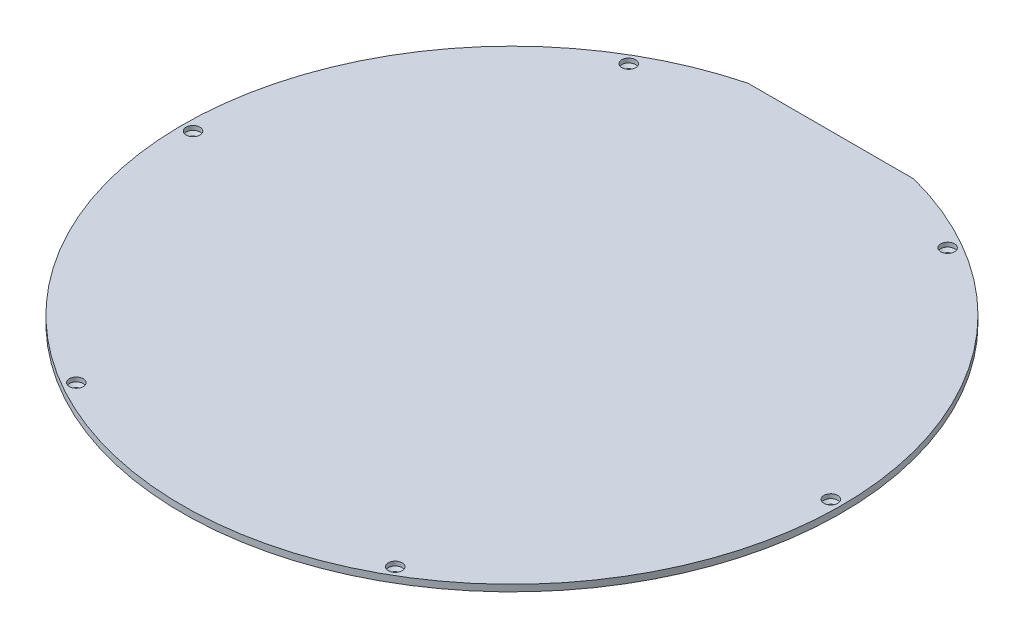
ISO-10303-21;
HEADER;
FILE_DESCRIPTION(('STEP AP214'),'2;1');
FILE_NAME('part.step','',(''),(''),'','','');
FILE_SCHEMA(('AUTOMOTIVE_DESIGN { 1 0 10303 214 1 1 1 1 }'));
ENDSEC;
DATA;
#1=APPLICATION_CONTEXT('core data for automotive mechanical design processes');
#2=APPLICATION_PROTOCOL_DEFINITION('international standard','automotive_design',2000,#1);
#3=PRODUCT_CONTEXT('',#1,'mechanical');
#4=PRODUCT('Part','Part','',(#3));
#5=PRODUCT_RELATED_PRODUCT_CATEGORY('part','',(#4));
#6=PRODUCT_DEFINITION_FORMATION('','',#4);
#7=PRODUCT_DEFINITION_CONTEXT('part definition',#1,'design');
#8=PRODUCT_DEFINITION('design','',#6,#7);
#9=PRODUCT_DEFINITION_SHAPE('','',#8);
#10=(LENGTH_UNIT() NAMED_UNIT(*) SI_UNIT(.MILLI.,.METRE.));
#11=(NAMED_UNIT(*) PLANE_ANGLE_UNIT() SI_UNIT($,.RADIAN.));
#12=(NAMED_UNIT(*) SI_UNIT($,.STERADIAN.) SOLID_ANGLE_UNIT());
#13=UNCERTAINTY_MEASURE_WITH_UNIT(LENGTH_MEASURE(1.E-05),#10,'distance_accuracy_value','');
#14=(GEOMETRIC_REPRESENTATION_CONTEXT(3) GLOBAL_UNCERTAINTY_ASSIGNED_CONTEXT((#13)) GLOBAL_UNIT_ASSIGNED_CONTEXT((#10,
#11,#12)) REPRESENTATION_CONTEXT('',''));
#15=CARTESIAN_POINT('',(0.,0.,0.));
#16=DIRECTION('',(0.,0.,1.));
#17=DIRECTION('',(1.,0.,0.));
#18=AXIS2_PLACEMENT_3D('',#15,#16,#17);
#19=CARTESIAN_POINT('',(0.,3.1,0.));
#20=DIRECTION('',(0.,-1.,0.));
#21=DIRECTION('',(0.,0.,-1.));
#22=AXIS2_PLACEMENT_3D('',#19,#20,#21);
#23=CYLINDRICAL_SURFACE('',#22,155.);
#24=CARTESIAN_POINT('',(0.,3.1,0.));
#25=DIRECTION('',(0.,1.,0.));
#26=DIRECTION('',(0.,0.,1.));
#27=AXIS2_PLACEMENT_3D('',#24,#25,#26);
#28=CIRCLE('',#27,155.);
#29=CARTESIAN_POINT('',(-39.0000000000001,3.1,-150.013332740793));
#30=VERTEX_POINT('',#29);
#31=CARTESIAN_POINT('',(39.,3.1,-150.013332740793));
#32=VERTEX_POINT('',#31);
#33=EDGE_CURVE('E11',#30,#32,#28,.T.);
#34=ORIENTED_EDGE('',*,*,#33,.F.);
#35=DIRECTION('',(0.,1.,0.));
#36=VECTOR('',#35,1.);
#37=CARTESIAN_POINT('',(-39.0000000000001,0.,-150.013332740793));
#38=LINE('',#37,#36);
#39=CARTESIAN_POINT('',(-39.0000000000001,0.,-150.013332740793));
#40=VERTEX_POINT('',#39);
#41=EDGE_CURVE('E61',#40,#30,#38,.T.);
#42=ORIENTED_EDGE('',*,*,#41,.F.);
#43=CARTESIAN_POINT('',(0.,0.,0.));
#44=DIRECTION('',(0.,1.,0.));
#45=DIRECTION('',(0.,0.,1.));
#46=AXIS2_PLACEMENT_3D('',#43,#44,#45);
#47=CIRCLE('',#46,155.);
#48=CARTESIAN_POINT('',(39.0000000000001,0.,-150.013332740793));
#49=VERTEX_POINT('',#48);
#50=EDGE_CURVE('E38',#40,#49,#47,.T.);
#51=ORIENTED_EDGE('',*,*,#50,.T.);
#52=DIRECTION('',(0.,1.,0.));
#53=VECTOR('',#52,1.);
#54=CARTESIAN_POINT('',(39.,0.,-150.013332740793));
#55=LINE('',#54,#53);
#56=EDGE_CURVE('E49',#49,#32,#55,.T.);
#57=ORIENTED_EDGE('',*,*,#56,.T.);
#58=EDGE_LOOP('',(#34,#42,#51,#57));
#59=FACE_BOUND('',#58,.T.);
#60=ADVANCED_FACE('F34',(#59),#23,.T.);
#61=CARTESIAN_POINT('',(0.,3.1,0.));
#62=DIRECTION('',(0.,1.,0.));
#63=DIRECTION('',(0.,0.,1.));
#64=AXIS2_PLACEMENT_3D('',#61,#62,#63);
#65=PLANE('',#64);
#66=DIRECTION('',(1.,0.,0.));
#67=VECTOR('',#66,1.);
#68=CARTESIAN_POINT('',(0.,3.1,-150.013332740793));
#69=LINE('',#68,#67);
#70=EDGE_CURVE('E59',#30,#32,#69,.T.);
#71=ORIENTED_EDGE('',*,*,#70,.F.);
#72=ORIENTED_EDGE('',*,*,#33,.T.);
#73=EDGE_LOOP('',(#71,#72));
#74=FACE_BOUND('',#73,.T.);
#75=CARTESIAN_POINT('',(75.0000000000015,3.1,-129.903810567665));
#76=DIRECTION('',(0.,1.,0.));
#77=DIRECTION('',(0.866025403784433,0.,0.50000000000001));
#78=AXIS2_PLACEMENT_3D('',#75,#76,#77);
#79=CIRCLE('',#78,3.25000000000001);
#80=CARTESIAN_POINT('',(77.8145825623009,3.1,-128.278810567665));
#81=VERTEX_POINT('',#80);
#82=EDGE_CURVE('E77',#81,#81,#79,.T.);
#83=ORIENTED_EDGE('',*,*,#82,.F.);
#84=EDGE_LOOP('',(#83));
#85=FACE_BOUND('',#84,.T.);
#86=CARTESIAN_POINT('',(-74.9999999999988,3.1,-129.903810567667));
#87=DIRECTION('',(0.,1.,0.));
#88=DIRECTION('',(0.866025403784443,0.,-0.499999999999992));
#89=AXIS2_PLACEMENT_3D('',#86,#87,#88);
#90=CIRCLE('',#89,3.25000000000001);
#91=CARTESIAN_POINT('',(-72.1854174376994,3.1,-131.528810567666));
#92=VERTEX_POINT('',#91);
#93=EDGE_CURVE('E81',#92,#92,#90,.T.);
#94=ORIENTED_EDGE('',*,*,#93,.F.);
#95=EDGE_LOOP('',(#94));
#96=FACE_BOUND('',#95,.T.);
#97=CARTESIAN_POINT('',(-150.,3.1,0.));
#98=DIRECTION('',(0.,1.,0.));
#99=DIRECTION('',(0.,0.,-1.));
#100=AXIS2_PLACEMENT_3D('',#97,#98,#99);
#101=CIRCLE('',#100,3.25000000000001);
#102=CARTESIAN_POINT('',(-150.,3.1,-3.25000000000001));
#103=VERTEX_POINT('',#102);
#104=EDGE_CURVE('E85',#103,#103,#101,.T.);
#105=ORIENTED_EDGE('',*,*,#104,.F.);
#106=EDGE_LOOP('',(#105));
#107=FACE_BOUND('',#106,.T.);
#108=CARTESIAN_POINT('',(-75.0000000000006,3.1,129.903810567665));
#109=DIRECTION('',(0.,1.,0.));
#110=DIRECTION('',(-0.866025403784436,0.,-0.500000000000004));
#111=AXIS2_PLACEMENT_3D('',#108,#109,#110);
#112=CIRCLE('',#111,3.25000000000001);
#113=CARTESIAN_POINT('',(-77.8145825623,3.1,128.278810567665));
#114=VERTEX_POINT('',#113);
#115=EDGE_CURVE('E89',#114,#114,#112,.T.);
#116=ORIENTED_EDGE('',*,*,#115,.F.);
#117=EDGE_LOOP('',(#116));
#118=FACE_BOUND('',#117,.T.);
#119=CARTESIAN_POINT('',(74.9999999999997,3.1,129.903810567666));
#120=DIRECTION('',(0.,1.,0.));
#121=DIRECTION('',(-0.86602540378444,0.,0.499999999999998));
#122=AXIS2_PLACEMENT_3D('',#119,#120,#121);
#123=CIRCLE('',#122,3.25000000000001);
#124=CARTESIAN_POINT('',(72.1854174377003,3.1,131.528810567666));
#125=VERTEX_POINT('',#124);
#126=EDGE_CURVE('E93',#125,#125,#123,.T.);
#127=ORIENTED_EDGE('',*,*,#126,.F.);
#128=EDGE_LOOP('',(#127));
#129=FACE_BOUND('',#128,.T.);
#130=CARTESIAN_POINT('',(150.,3.1,0.));
#131=DIRECTION('',(0.,1.,0.));
#132=DIRECTION('',(0.,0.,1.));
#133=AXIS2_PLACEMENT_3D('',#130,#131,#132);
#134=CIRCLE('',#133,3.25000000000001);
#135=CARTESIAN_POINT('',(150.,3.1,3.25000000000001));
#136=VERTEX_POINT('',#135);
#137=EDGE_CURVE('E96',#136,#136,#134,.T.);
#138=ORIENTED_EDGE('',*,*,#137,.F.);
#139=EDGE_LOOP('',(#138));
#140=FACE_BOUND('',#139,.T.);
#141=ADVANCED_FACE('F69',(#74,#85,#96,#107,#118,#129,#140),#65,.T.);
#142=CARTESIAN_POINT('',(0.,0.,0.));
#143=DIRECTION('',(0.,1.,0.));
#144=DIRECTION('',(0.,0.,1.));
#145=AXIS2_PLACEMENT_3D('',#142,#143,#144);
#146=PLANE('',#145);
#147=CARTESIAN_POINT('',(75.0000000000015,0.,-129.903810567665));
#148=DIRECTION('',(0.,1.,0.));
#149=DIRECTION('',(0.866025403784433,0.,0.50000000000001));
#150=AXIS2_PLACEMENT_3D('',#147,#148,#149);
#151=CIRCLE('',#150,1.64999999999999);
#152=CARTESIAN_POINT('',(76.4289419162458,0.,-129.078810567665));
#153=VERTEX_POINT('',#152);
#154=EDGE_CURVE('E174',#153,#153,#151,.T.);
#155=ORIENTED_EDGE('',*,*,#154,.T.);
#156=EDGE_LOOP('',(#155));
#157=FACE_BOUND('',#156,.T.);
#158=CARTESIAN_POINT('',(-74.9999999999988,0.,-129.903810567667));
#159=DIRECTION('',(0.,1.,0.));
#160=DIRECTION('',(0.866025403784443,0.,-0.499999999999992));
#161=AXIS2_PLACEMENT_3D('',#158,#159,#160);
#162=CIRCLE('',#161,1.64999999999999);
#163=CARTESIAN_POINT('',(-73.5710580837545,0.,-130.728810567666));
#164=VERTEX_POINT('',#163);
#165=EDGE_CURVE('E156',#164,#164,#162,.T.);
#166=ORIENTED_EDGE('',*,*,#165,.T.);
#167=EDGE_LOOP('',(#166));
#168=FACE_BOUND('',#167,.T.);
#169=CARTESIAN_POINT('',(-150.,0.,0.));
#170=DIRECTION('',(0.,1.,0.));
#171=DIRECTION('',(0.,0.,-1.));
#172=AXIS2_PLACEMENT_3D('',#169,#170,#171);
#173=CIRCLE('',#172,1.64999999999999);
#174=CARTESIAN_POINT('',(-150.,0.,-1.64999999999999));
#175=VERTEX_POINT('',#174);
#176=EDGE_CURVE('E179',#175,#175,#173,.T.);
#177=ORIENTED_EDGE('',*,*,#176,.T.);
#178=EDGE_LOOP('',(#177));
#179=FACE_BOUND('',#178,.T.);
#180=CARTESIAN_POINT('',(-75.0000000000006,0.,129.903810567665));
#181=DIRECTION('',(0.,1.,0.));
#182=DIRECTION('',(-0.866025403784436,0.,-0.500000000000004));
#183=AXIS2_PLACEMENT_3D('',#180,#181,#182);
#184=CIRCLE('',#183,1.64999999999999);
#185=CARTESIAN_POINT('',(-76.4289419162449,0.,129.078810567665));
#186=VERTEX_POINT('',#185);
#187=EDGE_CURVE('E105',#186,#186,#184,.T.);
#188=ORIENTED_EDGE('',*,*,#187,.T.);
#189=EDGE_LOOP('',(#188));
#190=FACE_BOUND('',#189,.T.);
#191=CARTESIAN_POINT('',(74.9999999999997,0.,129.903810567666));
#192=DIRECTION('',(0.,1.,0.));
#193=DIRECTION('',(-0.86602540378444,0.,0.499999999999998));
#194=AXIS2_PLACEMENT_3D('',#191,#192,#193);
#195=CIRCLE('',#194,1.64999999999999);
#196=CARTESIAN_POINT('',(73.5710580837554,0.,130.728810567666));
#197=VERTEX_POINT('',#196);
#198=EDGE_CURVE('E99',#197,#197,#195,.T.);
#199=ORIENTED_EDGE('',*,*,#198,.T.);
#200=EDGE_LOOP('',(#199));
#201=FACE_BOUND('',#200,.T.);
#202=CARTESIAN_POINT('',(150.,0.,0.));
#203=DIRECTION('',(0.,1.,0.));
#204=DIRECTION('',(0.,0.,1.));
#205=AXIS2_PLACEMENT_3D('',#202,#203,#204);
#206=CIRCLE('',#205,1.64999999999999);
#207=CARTESIAN_POINT('',(150.,0.,1.64999999999999));
#208=VERTEX_POINT('',#207);
#209=EDGE_CURVE('E102',#208,#208,#206,.T.);
#210=ORIENTED_EDGE('',*,*,#209,.T.);
#211=EDGE_LOOP('',(#210));
#212=FACE_BOUND('',#211,.T.);
#213=ORIENTED_EDGE('',*,*,#50,.F.);
#214=DIRECTION('',(1.,0.,0.));
#215=VECTOR('',#214,1.);
#216=CARTESIAN_POINT('',(0.,0.,-150.013332740793));
#217=LINE('',#216,#215);
#218=EDGE_CURVE('E54',#40,#49,#217,.T.);
#219=ORIENTED_EDGE('',*,*,#218,.T.);
#220=EDGE_LOOP('',(#213,#219));
#221=FACE_BOUND('',#220,.T.);
#222=ADVANCED_FACE('F72',(#157,#168,#179,#190,#201,#212,#221),#146,.F.);
#223=CARTESIAN_POINT('',(150.,1.1,0.));
#224=DIRECTION('',(0.,1.,0.));
#225=DIRECTION('',(0.,0.,1.));
#226=AXIS2_PLACEMENT_3D('',#223,#224,#225);
#227=CYLINDRICAL_SURFACE('',#226,3.25000000000001);
#228=CARTESIAN_POINT('',(150.,1.1,0.));
#229=DIRECTION('',(0.,1.,0.));
#230=DIRECTION('',(0.,0.,1.));
#231=AXIS2_PLACEMENT_3D('',#228,#229,#230);
#232=CIRCLE('',#231,3.25000000000001);
#233=CARTESIAN_POINT('',(150.,1.1,3.25000000000001));
#234=VERTEX_POINT('',#233);
#235=EDGE_CURVE('E98',#234,#234,#232,.T.);
#236=ORIENTED_EDGE('',*,*,#235,.F.);
#237=EDGE_LOOP('',(#236));
#238=FACE_BOUND('',#237,.T.);
#239=ORIENTED_EDGE('',*,*,#137,.T.);
#240=EDGE_LOOP('',(#239));
#241=FACE_BOUND('',#240,.T.);
#242=ADVANCED_FACE('F117',(#238,#241),#227,.F.);
#243=CARTESIAN_POINT('',(150.,1.1,0.));
#244=DIRECTION('',(0.,1.,0.));
#245=DIRECTION('',(0.,0.,1.));
#246=AXIS2_PLACEMENT_3D('',#243,#244,#245);
#247=CONICAL_SURFACE('',#246,3.24999999999992,0.968508980659927);
#248=ORIENTED_EDGE('',*,*,#209,.F.);
#249=EDGE_LOOP('',(#248));
#250=FACE_BOUND('',#249,.T.);
#251=ORIENTED_EDGE('',*,*,#235,.T.);
#252=EDGE_LOOP('',(#251));
#253=FACE_BOUND('',#252,.T.);
#254=ADVANCED_FACE('F113',(#250,#253),#247,.F.);
#255=CARTESIAN_POINT('',(75.0000000000015,1.1,-129.903810567665));
#256=DIRECTION('',(0.,1.,0.));
#257=DIRECTION('',(0.,0.,1.));
#258=AXIS2_PLACEMENT_3D('',#255,#256,#257);
#259=CYLINDRICAL_SURFACE('',#258,3.25000000000001);
#260=CARTESIAN_POINT('',(75.0000000000015,1.1,-129.903810567665));
#261=DIRECTION('',(0.,1.,0.));
#262=DIRECTION('',(0.866025403784433,0.,0.50000000000001));
#263=AXIS2_PLACEMENT_3D('',#260,#261,#262);
#264=CIRCLE('',#263,3.25000000000001);
#265=CARTESIAN_POINT('',(77.8145825623009,1.1,-128.278810567665));
#266=VERTEX_POINT('',#265);
#267=EDGE_CURVE('E164',#266,#266,#264,.T.);
#268=ORIENTED_EDGE('',*,*,#267,.F.);
#269=EDGE_LOOP('',(#268));
#270=FACE_BOUND('',#269,.T.);
#271=ORIENTED_EDGE('',*,*,#82,.T.);
#272=EDGE_LOOP('',(#271));
#273=FACE_BOUND('',#272,.T.);
#274=ADVANCED_FACE('F116',(#270,#273),#259,.F.);
#275=CARTESIAN_POINT('',(-74.9999999999988,1.1,-129.903810567667));
#276=DIRECTION('',(0.,1.,0.));
#277=DIRECTION('',(0.,0.,1.));
#278=AXIS2_PLACEMENT_3D('',#275,#276,#277);
#279=CYLINDRICAL_SURFACE('',#278,3.25000000000001);
#280=CARTESIAN_POINT('',(-74.9999999999988,1.1,-129.903810567667));
#281=DIRECTION('',(0.,1.,0.));
#282=DIRECTION('',(0.866025403784443,0.,-0.499999999999992));
#283=AXIS2_PLACEMENT_3D('',#280,#281,#282);
#284=CIRCLE('',#283,3.25000000000001);
#285=CARTESIAN_POINT('',(-72.1854174376994,1.1,-131.528810567666));
#286=VERTEX_POINT('',#285);
#287=EDGE_CURVE('E159',#286,#286,#284,.T.);
#288=ORIENTED_EDGE('',*,*,#287,.F.);
#289=EDGE_LOOP('',(#288));
#290=FACE_BOUND('',#289,.T.);
#291=ORIENTED_EDGE('',*,*,#93,.T.);
#292=EDGE_LOOP('',(#291));
#293=FACE_BOUND('',#292,.T.);
#294=ADVANCED_FACE('F191',(#290,#293),#279,.F.);
#295=CARTESIAN_POINT('',(-150.,1.1,0.));
#296=DIRECTION('',(0.,1.,0.));
#297=DIRECTION('',(0.,0.,1.));
#298=AXIS2_PLACEMENT_3D('',#295,#296,#297);
#299=CYLINDRICAL_SURFACE('',#298,3.25000000000001);
#300=CARTESIAN_POINT('',(-150.,1.1,0.));
#301=DIRECTION('',(0.,1.,0.));
#302=DIRECTION('',(0.,0.,-1.));
#303=AXIS2_PLACEMENT_3D('',#300,#301,#302);
#304=CIRCLE('',#303,3.25000000000001);
#305=CARTESIAN_POINT('',(-150.,1.1,-3.25000000000001));
#306=VERTEX_POINT('',#305);
#307=EDGE_CURVE('E162',#306,#306,#304,.T.);
#308=ORIENTED_EDGE('',*,*,#307,.F.);
#309=EDGE_LOOP('',(#308));
#310=FACE_BOUND('',#309,.T.);
#311=ORIENTED_EDGE('',*,*,#104,.T.);
#312=EDGE_LOOP('',(#311));
#313=FACE_BOUND('',#312,.T.);
#314=ADVANCED_FACE('F196',(#310,#313),#299,.F.);
#315=CARTESIAN_POINT('',(-75.0000000000006,1.1,129.903810567665));
#316=DIRECTION('',(0.,1.,0.));
#317=DIRECTION('',(0.,0.,1.));
#318=AXIS2_PLACEMENT_3D('',#315,#316,#317);
#319=CYLINDRICAL_SURFACE('',#318,3.25000000000001);
#320=CARTESIAN_POINT('',(-75.0000000000006,1.1,129.903810567665));
#321=DIRECTION('',(0.,1.,0.));
#322=DIRECTION('',(-0.866025403784436,0.,-0.500000000000004));
#323=AXIS2_PLACEMENT_3D('',#320,#321,#322);
#324=CIRCLE('',#323,3.25000000000001);
#325=CARTESIAN_POINT('',(-77.8145825623,1.1,128.278810567665));
#326=VERTEX_POINT('',#325);
#327=EDGE_CURVE('E176',#326,#326,#324,.T.);
#328=ORIENTED_EDGE('',*,*,#327,.F.);
#329=EDGE_LOOP('',(#328));
#330=FACE_BOUND('',#329,.T.);
#331=ORIENTED_EDGE('',*,*,#115,.T.);
#332=EDGE_LOOP('',(#331));
#333=FACE_BOUND('',#332,.T.);
#334=ADVANCED_FACE('F200',(#330,#333),#319,.F.);
#335=CARTESIAN_POINT('',(74.9999999999997,1.1,129.903810567666));
#336=DIRECTION('',(0.,1.,0.));
#337=DIRECTION('',(0.,0.,1.));
#338=AXIS2_PLACEMENT_3D('',#335,#336,#337);
#339=CYLINDRICAL_SURFACE('',#338,3.25000000000001);
#340=CARTESIAN_POINT('',(74.9999999999997,1.1,129.903810567666));
#341=DIRECTION('',(0.,1.,0.));
#342=DIRECTION('',(-0.86602540378444,0.,0.499999999999998));
#343=AXIS2_PLACEMENT_3D('',#340,#341,#342);
#344=CIRCLE('',#343,3.25000000000001);
#345=CARTESIAN_POINT('',(72.1854174377003,1.1,131.528810567666));
#346=VERTEX_POINT('',#345);
#347=EDGE_CURVE('E171',#346,#346,#344,.T.);
#348=ORIENTED_EDGE('',*,*,#347,.F.);
#349=EDGE_LOOP('',(#348));
#350=FACE_BOUND('',#349,.T.);
#351=ORIENTED_EDGE('',*,*,#126,.T.);
#352=EDGE_LOOP('',(#351));
#353=FACE_BOUND('',#352,.T.);
#354=ADVANCED_FACE('F138',(#350,#353),#339,.F.);
#355=CARTESIAN_POINT('',(74.9999999999997,1.1,129.903810567666));
#356=DIRECTION('',(0.,1.,0.));
#357=DIRECTION('',(0.,0.,1.));
#358=AXIS2_PLACEMENT_3D('',#355,#356,#357);
#359=CONICAL_SURFACE('',#358,3.24999999999981,0.968508980659931);
#360=ORIENTED_EDGE('',*,*,#198,.F.);
#361=EDGE_LOOP('',(#360));
#362=FACE_BOUND('',#361,.T.);
#363=ORIENTED_EDGE('',*,*,#347,.T.);
#364=EDGE_LOOP('',(#363));
#365=FACE_BOUND('',#364,.T.);
#366=ADVANCED_FACE('F134',(#362,#365),#359,.F.);
#367=CARTESIAN_POINT('',(-75.0000000000006,1.1,129.903810567665));
#368=DIRECTION('',(0.,1.,0.));
#369=DIRECTION('',(0.,0.,1.));
#370=AXIS2_PLACEMENT_3D('',#367,#368,#369);
#371=CONICAL_SURFACE('',#370,3.24999999999981,0.968508980659931);
#372=ORIENTED_EDGE('',*,*,#187,.F.);
#373=EDGE_LOOP('',(#372));
#374=FACE_BOUND('',#373,.T.);
#375=ORIENTED_EDGE('',*,*,#327,.T.);
#376=EDGE_LOOP('',(#375));
#377=FACE_BOUND('',#376,.T.);
#378=ADVANCED_FACE('F137',(#374,#377),#371,.F.);
#379=CARTESIAN_POINT('',(-150.,1.1,0.));
#380=DIRECTION('',(0.,1.,0.));
#381=DIRECTION('',(0.,0.,1.));
#382=AXIS2_PLACEMENT_3D('',#379,#380,#381);
#383=CONICAL_SURFACE('',#382,3.24999999999992,0.968508980659927);
#384=ORIENTED_EDGE('',*,*,#176,.F.);
#385=EDGE_LOOP('',(#384));
#386=FACE_BOUND('',#385,.T.);
#387=ORIENTED_EDGE('',*,*,#307,.T.);
#388=EDGE_LOOP('',(#387));
#389=FACE_BOUND('',#388,.T.);
#390=ADVANCED_FACE('F142',(#386,#389),#383,.F.);
#391=CARTESIAN_POINT('',(-74.9999999999988,1.1,-129.903810567667));
#392=DIRECTION('',(0.,1.,0.));
#393=DIRECTION('',(0.,0.,1.));
#394=AXIS2_PLACEMENT_3D('',#391,#392,#393);
#395=CONICAL_SURFACE('',#394,3.24999999999981,0.968508980659931);
#396=ORIENTED_EDGE('',*,*,#165,.F.);
#397=EDGE_LOOP('',(#396));
#398=FACE_BOUND('',#397,.T.);
#399=ORIENTED_EDGE('',*,*,#287,.T.);
#400=EDGE_LOOP('',(#399));
#401=FACE_BOUND('',#400,.T.);
#402=ADVANCED_FACE('F145',(#398,#401),#395,.F.);
#403=CARTESIAN_POINT('',(75.0000000000015,1.1,-129.903810567665));
#404=DIRECTION('',(0.,1.,0.));
#405=DIRECTION('',(0.,0.,1.));
#406=AXIS2_PLACEMENT_3D('',#403,#404,#405);
#407=CONICAL_SURFACE('',#406,3.24999999999981,0.968508980659931);
#408=ORIENTED_EDGE('',*,*,#154,.F.);
#409=EDGE_LOOP('',(#408));
#410=FACE_BOUND('',#409,.T.);
#411=ORIENTED_EDGE('',*,*,#267,.T.);
#412=EDGE_LOOP('',(#411));
#413=FACE_BOUND('',#412,.T.);
#414=ADVANCED_FACE('F36',(#410,#413),#407,.F.);
#415=CARTESIAN_POINT('',(0.,0.,-150.013332740793));
#416=DIRECTION('',(0.,0.,1.));
#417=DIRECTION('',(1.,0.,0.));
#418=AXIS2_PLACEMENT_3D('',#415,#416,#417);
#419=PLANE('',#418);
#420=ORIENTED_EDGE('',*,*,#70,.T.);
#421=ORIENTED_EDGE('',*,*,#56,.F.);
#422=ORIENTED_EDGE('',*,*,#218,.F.);
#423=ORIENTED_EDGE('',*,*,#41,.T.);
#424=EDGE_LOOP('',(#420,#421,#422,#423));
#425=FACE_BOUND('',#424,.T.);
#426=ADVANCED_FACE('F60',(#425),#419,.F.);
#427=CLOSED_SHELL('',(#60,#141,#222,#242,#254,#274,#294,#314,#334,#354,#366,#378,#390,#402,#414,#426));
#428=MANIFOLD_SOLID_BREP('B2',#427);
#429=ADVANCED_BREP_SHAPE_REPRESENTATION('',(#18,#428),#14);
#430=SHAPE_DEFINITION_REPRESENTATION(#9,#429);
ENDSEC;
END-ISO-10303-21;
